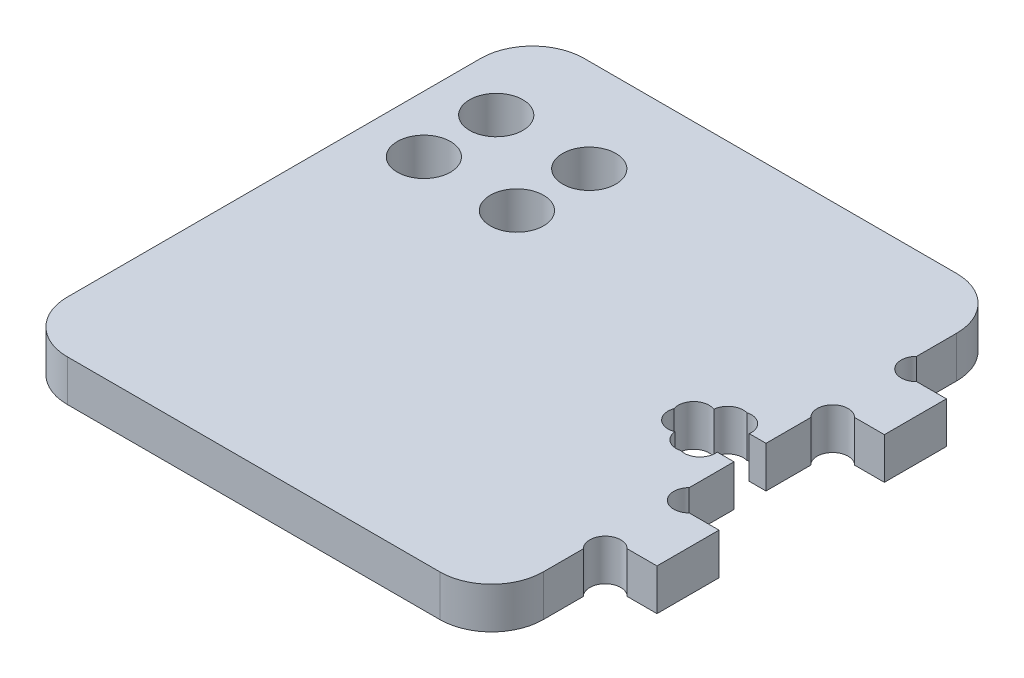
ISO-10303-21;
HEADER;
FILE_DESCRIPTION(('STEP AP214'),'2;1');
FILE_NAME('part.step','',(''),(''),'','','');
FILE_SCHEMA(('AUTOMOTIVE_DESIGN { 1 0 10303 214 1 1 1 1 }'));
ENDSEC;
DATA;
#1=APPLICATION_CONTEXT('core data for automotive mechanical design processes');
#2=APPLICATION_PROTOCOL_DEFINITION('international standard','automotive_design',2000,#1);
#3=PRODUCT_CONTEXT('',#1,'mechanical');
#4=PRODUCT('Part','Part','',(#3));
#5=PRODUCT_RELATED_PRODUCT_CATEGORY('part','',(#4));
#6=PRODUCT_DEFINITION_FORMATION('','',#4);
#7=PRODUCT_DEFINITION_CONTEXT('part definition',#1,'design');
#8=PRODUCT_DEFINITION('design','',#6,#7);
#9=PRODUCT_DEFINITION_SHAPE('','',#8);
#10=(LENGTH_UNIT() NAMED_UNIT(*) SI_UNIT(.MILLI.,.METRE.));
#11=(NAMED_UNIT(*) PLANE_ANGLE_UNIT() SI_UNIT($,.RADIAN.));
#12=(NAMED_UNIT(*) SI_UNIT($,.STERADIAN.) SOLID_ANGLE_UNIT());
#13=UNCERTAINTY_MEASURE_WITH_UNIT(LENGTH_MEASURE(1.E-05),#10,'distance_accuracy_value','');
#14=(GEOMETRIC_REPRESENTATION_CONTEXT(3) GLOBAL_UNCERTAINTY_ASSIGNED_CONTEXT((#13)) GLOBAL_UNIT_ASSIGNED_CONTEXT((#10,
#11,#12)) REPRESENTATION_CONTEXT('',''));
#15=CARTESIAN_POINT('',(0.,0.,0.));
#16=DIRECTION('',(0.,0.,1.));
#17=DIRECTION('',(1.,0.,0.));
#18=AXIS2_PLACEMENT_3D('',#15,#16,#17);
#19=CARTESIAN_POINT('',(-18.025,4.,20.));
#20=DIRECTION('',(0.,-1.,0.));
#21=DIRECTION('',(0.,0.,-1.));
#22=AXIS2_PLACEMENT_3D('',#19,#20,#21);
#23=CYLINDRICAL_SURFACE('',#22,5.);
#24=CARTESIAN_POINT('',(-18.025,0.,20.));
#25=DIRECTION('',(0.,1.,0.));
#26=DIRECTION('',(0.,0.,-1.));
#27=AXIS2_PLACEMENT_3D('',#24,#25,#26);
#28=CIRCLE('',#27,5.);
#29=CARTESIAN_POINT('',(-23.025,0.,20.));
#30=VERTEX_POINT('',#29);
#31=CARTESIAN_POINT('',(-18.025,0.,25.));
#32=VERTEX_POINT('',#31);
#33=EDGE_CURVE('E171',#30,#32,#28,.T.);
#34=ORIENTED_EDGE('',*,*,#33,.T.);
#35=DIRECTION('',(0.,-1.,0.));
#36=VECTOR('',#35,1.);
#37=CARTESIAN_POINT('',(-18.025,4.,25.));
#38=LINE('',#37,#36);
#39=CARTESIAN_POINT('',(-18.025,4.,25.));
#40=VERTEX_POINT('',#39);
#41=EDGE_CURVE('E244',#40,#32,#38,.T.);
#42=ORIENTED_EDGE('',*,*,#41,.F.);
#43=CARTESIAN_POINT('',(-18.025,4.,20.));
#44=DIRECTION('',(0.,1.,0.));
#45=DIRECTION('',(0.,0.,-1.));
#46=AXIS2_PLACEMENT_3D('',#43,#44,#45);
#47=CIRCLE('',#46,5.);
#48=CARTESIAN_POINT('',(-23.025,4.,20.));
#49=VERTEX_POINT('',#48);
#50=EDGE_CURVE('E213',#49,#40,#47,.T.);
#51=ORIENTED_EDGE('',*,*,#50,.F.);
#52=DIRECTION('',(0.,-1.,0.));
#53=VECTOR('',#52,1.);
#54=CARTESIAN_POINT('',(-23.025,4.,20.));
#55=LINE('',#54,#53);
#56=EDGE_CURVE('E167',#49,#30,#55,.T.);
#57=ORIENTED_EDGE('',*,*,#56,.T.);
#58=EDGE_LOOP('',(#34,#42,#51,#57));
#59=FACE_BOUND('',#58,.T.);
#60=ADVANCED_FACE('F33',(#59),#23,.T.);
#61=CARTESIAN_POINT('',(-18.025,4.,25.));
#62=DIRECTION('',(0.,0.,-1.));
#63=DIRECTION('',(-1.,0.,0.));
#64=AXIS2_PLACEMENT_3D('',#61,#62,#63);
#65=PLANE('',#64);
#66=DIRECTION('',(1.,0.,0.));
#67=VECTOR('',#66,1.);
#68=CARTESIAN_POINT('',(-18.025,0.,25.));
#69=LINE('',#68,#67);
#70=CARTESIAN_POINT('',(18.025,0.,25.));
#71=VERTEX_POINT('',#70);
#72=EDGE_CURVE('E174',#32,#71,#69,.T.);
#73=ORIENTED_EDGE('',*,*,#72,.T.);
#74=DIRECTION('',(0.,-1.,0.));
#75=VECTOR('',#74,1.);
#76=CARTESIAN_POINT('',(18.025,4.,25.));
#77=LINE('',#76,#75);
#78=CARTESIAN_POINT('',(18.025,4.,25.));
#79=VERTEX_POINT('',#78);
#80=EDGE_CURVE('E241',#79,#71,#77,.T.);
#81=ORIENTED_EDGE('',*,*,#80,.F.);
#82=DIRECTION('',(1.,0.,0.));
#83=VECTOR('',#82,1.);
#84=CARTESIAN_POINT('',(-18.025,4.,25.));
#85=LINE('',#84,#83);
#86=EDGE_CURVE('E112',#40,#79,#85,.T.);
#87=ORIENTED_EDGE('',*,*,#86,.F.);
#88=ORIENTED_EDGE('',*,*,#41,.T.);
#89=EDGE_LOOP('',(#73,#81,#87,#88));
#90=FACE_BOUND('',#89,.T.);
#91=ADVANCED_FACE('F367',(#90),#65,.F.);
#92=CARTESIAN_POINT('',(18.025,4.,20.));
#93=DIRECTION('',(0.,-1.,0.));
#94=DIRECTION('',(0.,0.,-1.));
#95=AXIS2_PLACEMENT_3D('',#92,#93,#94);
#96=CYLINDRICAL_SURFACE('',#95,5.);
#97=CARTESIAN_POINT('',(18.025,0.,20.));
#98=DIRECTION('',(0.,1.,0.));
#99=DIRECTION('',(0.,0.,1.));
#100=AXIS2_PLACEMENT_3D('',#97,#98,#99);
#101=CIRCLE('',#100,5.);
#102=CARTESIAN_POINT('',(23.025,0.,20.));
#103=VERTEX_POINT('',#102);
#104=EDGE_CURVE('E177',#71,#103,#101,.T.);
#105=ORIENTED_EDGE('',*,*,#104,.T.);
#106=DIRECTION('',(0.,-1.,0.));
#107=VECTOR('',#106,1.);
#108=CARTESIAN_POINT('',(23.025,4.,20.));
#109=LINE('',#108,#107);
#110=CARTESIAN_POINT('',(23.025,4.,20.));
#111=VERTEX_POINT('',#110);
#112=EDGE_CURVE('E238',#111,#103,#109,.T.);
#113=ORIENTED_EDGE('',*,*,#112,.F.);
#114=CARTESIAN_POINT('',(18.025,4.,20.));
#115=DIRECTION('',(0.,1.,0.));
#116=DIRECTION('',(0.,0.,1.));
#117=AXIS2_PLACEMENT_3D('',#114,#115,#116);
#118=CIRCLE('',#117,5.);
#119=EDGE_CURVE('E745',#79,#111,#118,.T.);
#120=ORIENTED_EDGE('',*,*,#119,.F.);
#121=ORIENTED_EDGE('',*,*,#80,.T.);
#122=EDGE_LOOP('',(#105,#113,#120,#121));
#123=FACE_BOUND('',#122,.T.);
#124=ADVANCED_FACE('F371',(#123),#96,.T.);
#125=CARTESIAN_POINT('',(23.025,4.,20.));
#126=DIRECTION('',(-1.,0.,0.));
#127=DIRECTION('',(0.,0.,1.));
#128=AXIS2_PLACEMENT_3D('',#125,#126,#127);
#129=PLANE('',#128);
#130=DIRECTION('',(0.,0.,-1.));
#131=VECTOR('',#130,1.);
#132=CARTESIAN_POINT('',(23.025,0.,20.));
#133=LINE('',#132,#131);
#134=CARTESIAN_POINT('',(23.025,0.,16.1213203435597));
#135=VERTEX_POINT('',#134);
#136=EDGE_CURVE('E179',#103,#135,#133,.T.);
#137=ORIENTED_EDGE('',*,*,#136,.T.);
#138=DIRECTION('',(0.,1.,0.));
#139=VECTOR('',#138,1.);
#140=CARTESIAN_POINT('',(23.025,0.,16.1213203435597));
#141=LINE('',#140,#139);
#142=CARTESIAN_POINT('',(23.025,4.,16.1213203435597));
#143=VERTEX_POINT('',#142);
#144=EDGE_CURVE('E283',#135,#143,#141,.T.);
#145=ORIENTED_EDGE('',*,*,#144,.T.);
#146=DIRECTION('',(0.,0.,-1.));
#147=VECTOR('',#146,1.);
#148=CARTESIAN_POINT('',(23.025,4.,20.));
#149=LINE('',#148,#147);
#150=EDGE_CURVE('E747',#111,#143,#149,.T.);
#151=ORIENTED_EDGE('',*,*,#150,.F.);
#152=ORIENTED_EDGE('',*,*,#112,.T.);
#153=EDGE_LOOP('',(#137,#145,#151,#152));
#154=FACE_BOUND('',#153,.T.);
#155=ADVANCED_FACE('F375',(#154),#129,.F.);
#156=CARTESIAN_POINT('',(23.025,4.,14.));
#157=DIRECTION('',(0.,0.,-1.));
#158=DIRECTION('',(-1.,0.,0.));
#159=AXIS2_PLACEMENT_3D('',#156,#157,#158);
#160=PLANE('',#159);
#161=DIRECTION('',(1.,0.,0.));
#162=VECTOR('',#161,1.);
#163=CARTESIAN_POINT('',(23.025,4.,14.));
#164=LINE('',#163,#162);
#165=CARTESIAN_POINT('',(25.1463203435596,4.,14.));
#166=VERTEX_POINT('',#165);
#167=CARTESIAN_POINT('',(28.025,4.,14.));
#168=VERTEX_POINT('',#167);
#169=EDGE_CURVE('E292',#166,#168,#164,.T.);
#170=ORIENTED_EDGE('',*,*,#169,.F.);
#171=DIRECTION('',(0.,1.,0.));
#172=VECTOR('',#171,1.);
#173=CARTESIAN_POINT('',(25.1463203435596,0.,14.));
#174=LINE('',#173,#172);
#175=CARTESIAN_POINT('',(25.1463203435596,0.,14.));
#176=VERTEX_POINT('',#175);
#177=EDGE_CURVE('E279',#166,#176,#174,.F.);
#178=ORIENTED_EDGE('',*,*,#177,.T.);
#179=DIRECTION('',(1.,0.,0.));
#180=VECTOR('',#179,1.);
#181=CARTESIAN_POINT('',(23.025,0.,14.));
#182=LINE('',#181,#180);
#183=CARTESIAN_POINT('',(28.025,0.,14.));
#184=VERTEX_POINT('',#183);
#185=EDGE_CURVE('E182',#176,#184,#182,.T.);
#186=ORIENTED_EDGE('',*,*,#185,.T.);
#187=DIRECTION('',(0.,-1.,0.));
#188=VECTOR('',#187,1.);
#189=CARTESIAN_POINT('',(28.025,4.,14.));
#190=LINE('',#189,#188);
#191=EDGE_CURVE('E235',#168,#184,#190,.T.);
#192=ORIENTED_EDGE('',*,*,#191,.F.);
#193=EDGE_LOOP('',(#170,#178,#186,#192));
#194=FACE_BOUND('',#193,.T.);
#195=ADVANCED_FACE('F290',(#194),#160,.F.);
#196=CARTESIAN_POINT('',(28.025,4.,8.));
#197=DIRECTION('',(-1.,0.,0.));
#198=DIRECTION('',(0.,0.,1.));
#199=AXIS2_PLACEMENT_3D('',#196,#197,#198);
#200=PLANE('',#199);
#201=DIRECTION('',(0.,0.,-1.));
#202=VECTOR('',#201,1.);
#203=CARTESIAN_POINT('',(28.025,0.,8.));
#204=LINE('',#203,#202);
#205=CARTESIAN_POINT('',(28.025,0.,8.));
#206=VERTEX_POINT('',#205);
#207=EDGE_CURVE('E184',#184,#206,#204,.T.);
#208=ORIENTED_EDGE('',*,*,#207,.T.);
#209=DIRECTION('',(0.,-1.,0.));
#210=VECTOR('',#209,1.);
#211=CARTESIAN_POINT('',(28.025,4.,8.));
#212=LINE('',#211,#210);
#213=CARTESIAN_POINT('',(28.025,4.,8.));
#214=VERTEX_POINT('',#213);
#215=EDGE_CURVE('E232',#214,#206,#212,.T.);
#216=ORIENTED_EDGE('',*,*,#215,.F.);
#217=DIRECTION('',(0.,0.,-1.));
#218=VECTOR('',#217,1.);
#219=CARTESIAN_POINT('',(28.025,4.,8.));
#220=LINE('',#219,#218);
#221=EDGE_CURVE('E314',#168,#214,#220,.T.);
#222=ORIENTED_EDGE('',*,*,#221,.F.);
#223=ORIENTED_EDGE('',*,*,#191,.T.);
#224=EDGE_LOOP('',(#208,#216,#222,#223));
#225=FACE_BOUND('',#224,.T.);
#226=ADVANCED_FACE('F301',(#225),#200,.F.);
#227=CARTESIAN_POINT('',(23.025,4.,8.00000000000001));
#228=DIRECTION('',(0.,0.,1.));
#229=DIRECTION('',(1.,0.,0.));
#230=AXIS2_PLACEMENT_3D('',#227,#228,#229);
#231=PLANE('',#230);
#232=DIRECTION('',(-1.,0.,0.));
#233=VECTOR('',#232,1.);
#234=CARTESIAN_POINT('',(23.025,0.,8.00000000000001));
#235=LINE('',#234,#233);
#236=CARTESIAN_POINT('',(25.1463203435596,0.,8.00000000000001));
#237=VERTEX_POINT('',#236);
#238=EDGE_CURVE('E186',#206,#237,#235,.T.);
#239=ORIENTED_EDGE('',*,*,#238,.T.);
#240=DIRECTION('',(0.,1.,0.));
#241=VECTOR('',#240,1.);
#242=CARTESIAN_POINT('',(25.1463203435596,0.,8.00000000000001));
#243=LINE('',#242,#241);
#244=CARTESIAN_POINT('',(25.1463203435596,4.,8.00000000000001));
#245=VERTEX_POINT('',#244);
#246=EDGE_CURVE('E311',#237,#245,#243,.T.);
#247=ORIENTED_EDGE('',*,*,#246,.T.);
#248=DIRECTION('',(-1.,0.,0.));
#249=VECTOR('',#248,1.);
#250=CARTESIAN_POINT('',(23.025,4.,8.00000000000001));
#251=LINE('',#250,#249);
#252=EDGE_CURVE('E308',#214,#245,#251,.T.);
#253=ORIENTED_EDGE('',*,*,#252,.F.);
#254=ORIENTED_EDGE('',*,*,#215,.T.);
#255=EDGE_LOOP('',(#239,#247,#253,#254));
#256=FACE_BOUND('',#255,.T.);
#257=ADVANCED_FACE('F305',(#256),#231,.F.);
#258=CARTESIAN_POINT('',(23.025,4.,8.00000000000001));
#259=DIRECTION('',(-1.,0.,0.));
#260=DIRECTION('',(0.,0.,1.));
#261=AXIS2_PLACEMENT_3D('',#258,#259,#260);
#262=PLANE('',#261);
#263=DIRECTION('',(0.,0.,-1.));
#264=VECTOR('',#263,1.);
#265=CARTESIAN_POINT('',(23.025,4.,8.00000000000001));
#266=LINE('',#265,#264);
#267=CARTESIAN_POINT('',(23.025,4.,5.87867965644035));
#268=VERTEX_POINT('',#267);
#269=CARTESIAN_POINT('',(23.025,4.,1.55));
#270=VERTEX_POINT('',#269);
#271=EDGE_CURVE('E313',#268,#270,#266,.T.);
#272=ORIENTED_EDGE('',*,*,#271,.F.);
#273=DIRECTION('',(0.,1.,0.));
#274=VECTOR('',#273,1.);
#275=CARTESIAN_POINT('',(23.025,0.,5.87867965644035));
#276=LINE('',#275,#274);
#277=CARTESIAN_POINT('',(23.025,0.,5.87867965644035));
#278=VERTEX_POINT('',#277);
#279=EDGE_CURVE('E684',#268,#278,#276,.F.);
#280=ORIENTED_EDGE('',*,*,#279,.T.);
#281=DIRECTION('',(0.,0.,-1.));
#282=VECTOR('',#281,1.);
#283=CARTESIAN_POINT('',(23.025,0.,8.00000000000001));
#284=LINE('',#283,#282);
#285=CARTESIAN_POINT('',(23.025,0.,1.55));
#286=VERTEX_POINT('',#285);
#287=EDGE_CURVE('E189',#278,#286,#284,.T.);
#288=ORIENTED_EDGE('',*,*,#287,.T.);
#289=DIRECTION('',(0.,-1.,0.));
#290=VECTOR('',#289,1.);
#291=CARTESIAN_POINT('',(23.025,4.,1.55));
#292=LINE('',#291,#290);
#293=EDGE_CURVE('E229',#270,#286,#292,.T.);
#294=ORIENTED_EDGE('',*,*,#293,.F.);
#295=EDGE_LOOP('',(#272,#280,#288,#294));
#296=FACE_BOUND('',#295,.T.);
#297=ADVANCED_FACE('F388',(#296),#262,.F.);
#298=CARTESIAN_POINT('',(20.975,4.,1.55));
#299=DIRECTION('',(0.,0.,1.));
#300=DIRECTION('',(1.,0.,0.));
#301=AXIS2_PLACEMENT_3D('',#298,#299,#300);
#302=PLANE('',#301);
#303=DIRECTION('',(-1.,0.,0.));
#304=VECTOR('',#303,1.);
#305=CARTESIAN_POINT('',(20.975,0.,1.55));
#306=LINE('',#305,#304);
#307=CARTESIAN_POINT('',(21.4023419886519,0.,1.55));
#308=VERTEX_POINT('',#307);
#309=EDGE_CURVE('E191',#286,#308,#306,.T.);
#310=ORIENTED_EDGE('',*,*,#309,.T.);
#311=DIRECTION('',(0.,1.,0.));
#312=VECTOR('',#311,1.);
#313=CARTESIAN_POINT('',(21.4023419886519,0.,1.55));
#314=LINE('',#313,#312);
#315=CARTESIAN_POINT('',(21.4023419886519,4.,1.55));
#316=VERTEX_POINT('',#315);
#317=EDGE_CURVE('E726',#308,#316,#314,.T.);
#318=ORIENTED_EDGE('',*,*,#317,.T.);
#319=DIRECTION('',(-1.,0.,0.));
#320=VECTOR('',#319,1.);
#321=CARTESIAN_POINT('',(20.975,4.,1.55));
#322=LINE('',#321,#320);
#323=EDGE_CURVE('E316',#270,#316,#322,.T.);
#324=ORIENTED_EDGE('',*,*,#323,.F.);
#325=ORIENTED_EDGE('',*,*,#293,.T.);
#326=EDGE_LOOP('',(#310,#318,#324,#325));
#327=FACE_BOUND('',#326,.T.);
#328=ADVANCED_FACE('F391',(#327),#302,.F.);
#329=CARTESIAN_POINT('',(20.975,4.,-1.54999999999999));
#330=DIRECTION('',(0.,0.,-1.));
#331=DIRECTION('',(-1.,0.,0.));
#332=AXIS2_PLACEMENT_3D('',#329,#330,#331);
#333=PLANE('',#332);
#334=DIRECTION('',(1.,0.,0.));
#335=VECTOR('',#334,1.);
#336=CARTESIAN_POINT('',(20.975,4.,-1.54999999999999));
#337=LINE('',#336,#335);
#338=CARTESIAN_POINT('',(21.4023419886519,4.,-1.54999999999999));
#339=VERTEX_POINT('',#338);
#340=CARTESIAN_POINT('',(23.025,4.,-1.54999999999999));
#341=VERTEX_POINT('',#340);
#342=EDGE_CURVE('E323',#339,#341,#337,.T.);
#343=ORIENTED_EDGE('',*,*,#342,.F.);
#344=DIRECTION('',(0.,1.,0.));
#345=VECTOR('',#344,1.);
#346=CARTESIAN_POINT('',(21.4023419886519,0.,-1.54999999999999));
#347=LINE('',#346,#345);
#348=CARTESIAN_POINT('',(21.4023419886519,0.,-1.54999999999999));
#349=VERTEX_POINT('',#348);
#350=EDGE_CURVE('E175',#349,#339,#347,.T.);
#351=ORIENTED_EDGE('',*,*,#350,.F.);
#352=DIRECTION('',(1.,0.,0.));
#353=VECTOR('',#352,1.);
#354=CARTESIAN_POINT('',(20.975,0.,-1.54999999999999));
#355=LINE('',#354,#353);
#356=CARTESIAN_POINT('',(23.025,0.,-1.54999999999999));
#357=VERTEX_POINT('',#356);
#358=EDGE_CURVE('E194',#349,#357,#355,.T.);
#359=ORIENTED_EDGE('',*,*,#358,.T.);
#360=DIRECTION('',(0.,-1.,0.));
#361=VECTOR('',#360,1.);
#362=CARTESIAN_POINT('',(23.025,4.,-1.54999999999999));
#363=LINE('',#362,#361);
#364=EDGE_CURVE('E226',#341,#357,#363,.T.);
#365=ORIENTED_EDGE('',*,*,#364,.F.);
#366=EDGE_LOOP('',(#343,#351,#359,#365));
#367=FACE_BOUND('',#366,.T.);
#368=ADVANCED_FACE('F395',(#367),#333,.F.);
#369=CARTESIAN_POINT('',(23.025,4.,-1.54999999999999));
#370=DIRECTION('',(-1.,0.,0.));
#371=DIRECTION('',(0.,0.,1.));
#372=AXIS2_PLACEMENT_3D('',#369,#370,#371);
#373=PLANE('',#372);
#374=DIRECTION('',(0.,0.,-1.));
#375=VECTOR('',#374,1.);
#376=CARTESIAN_POINT('',(23.025,0.,-1.54999999999999));
#377=LINE('',#376,#375);
#378=CARTESIAN_POINT('',(23.025,0.,-5.87867965644035));
#379=VERTEX_POINT('',#378);
#380=EDGE_CURVE('E196',#357,#379,#377,.T.);
#381=ORIENTED_EDGE('',*,*,#380,.T.);
#382=DIRECTION('',(0.,1.,0.));
#383=VECTOR('',#382,1.);
#384=CARTESIAN_POINT('',(23.025,0.,-5.87867965644035));
#385=LINE('',#384,#383);
#386=CARTESIAN_POINT('',(23.025,4.,-5.87867965644035));
#387=VERTEX_POINT('',#386);
#388=EDGE_CURVE('E696',#379,#387,#385,.T.);
#389=ORIENTED_EDGE('',*,*,#388,.T.);
#390=DIRECTION('',(0.,0.,-1.));
#391=VECTOR('',#390,1.);
#392=CARTESIAN_POINT('',(23.025,4.,-1.54999999999999));
#393=LINE('',#392,#391);
#394=EDGE_CURVE('E325',#341,#387,#393,.T.);
#395=ORIENTED_EDGE('',*,*,#394,.F.);
#396=ORIENTED_EDGE('',*,*,#364,.T.);
#397=EDGE_LOOP('',(#381,#389,#395,#396));
#398=FACE_BOUND('',#397,.T.);
#399=ADVANCED_FACE('F399',(#398),#373,.F.);
#400=CARTESIAN_POINT('',(23.025,4.,-8.00000000000001));
#401=DIRECTION('',(0.,0.,-1.));
#402=DIRECTION('',(-1.,0.,0.));
#403=AXIS2_PLACEMENT_3D('',#400,#401,#402);
#404=PLANE('',#403);
#405=DIRECTION('',(1.,0.,0.));
#406=VECTOR('',#405,1.);
#407=CARTESIAN_POINT('',(23.025,4.,-8.00000000000001));
#408=LINE('',#407,#406);
#409=CARTESIAN_POINT('',(25.1463203435596,4.,-8.00000000000001));
#410=VERTEX_POINT('',#409);
#411=CARTESIAN_POINT('',(28.025,4.,-8.));
#412=VERTEX_POINT('',#411);
#413=EDGE_CURVE('E328',#410,#412,#408,.T.);
#414=ORIENTED_EDGE('',*,*,#413,.F.);
#415=DIRECTION('',(0.,1.,0.));
#416=VECTOR('',#415,1.);
#417=CARTESIAN_POINT('',(25.1463203435596,0.,-8.00000000000001));
#418=LINE('',#417,#416);
#419=CARTESIAN_POINT('',(25.1463203435596,0.,-8.00000000000001));
#420=VERTEX_POINT('',#419);
#421=EDGE_CURVE('E693',#410,#420,#418,.F.);
#422=ORIENTED_EDGE('',*,*,#421,.T.);
#423=DIRECTION('',(1.,0.,0.));
#424=VECTOR('',#423,1.);
#425=CARTESIAN_POINT('',(23.025,0.,-8.00000000000001));
#426=LINE('',#425,#424);
#427=CARTESIAN_POINT('',(28.025,0.,-8.));
#428=VERTEX_POINT('',#427);
#429=EDGE_CURVE('E199',#420,#428,#426,.T.);
#430=ORIENTED_EDGE('',*,*,#429,.T.);
#431=DIRECTION('',(0.,-1.,0.));
#432=VECTOR('',#431,1.);
#433=CARTESIAN_POINT('',(28.025,4.,-8.));
#434=LINE('',#433,#432);
#435=EDGE_CURVE('E223',#412,#428,#434,.T.);
#436=ORIENTED_EDGE('',*,*,#435,.F.);
#437=EDGE_LOOP('',(#414,#422,#430,#436));
#438=FACE_BOUND('',#437,.T.);
#439=ADVANCED_FACE('F403',(#438),#404,.F.);
#440=CARTESIAN_POINT('',(28.025,4.,-14.));
#441=DIRECTION('',(-1.,0.,0.));
#442=DIRECTION('',(0.,0.,1.));
#443=AXIS2_PLACEMENT_3D('',#440,#441,#442);
#444=PLANE('',#443);
#445=DIRECTION('',(0.,0.,-1.));
#446=VECTOR('',#445,1.);
#447=CARTESIAN_POINT('',(28.025,0.,-14.));
#448=LINE('',#447,#446);
#449=CARTESIAN_POINT('',(28.025,0.,-14.));
#450=VERTEX_POINT('',#449);
#451=EDGE_CURVE('E201',#428,#450,#448,.T.);
#452=ORIENTED_EDGE('',*,*,#451,.T.);
#453=DIRECTION('',(0.,-1.,0.));
#454=VECTOR('',#453,1.);
#455=CARTESIAN_POINT('',(28.025,4.,-14.));
#456=LINE('',#455,#454);
#457=CARTESIAN_POINT('',(28.025,4.,-14.));
#458=VERTEX_POINT('',#457);
#459=EDGE_CURVE('E220',#458,#450,#456,.T.);
#460=ORIENTED_EDGE('',*,*,#459,.F.);
#461=DIRECTION('',(0.,0.,-1.));
#462=VECTOR('',#461,1.);
#463=CARTESIAN_POINT('',(28.025,4.,-14.));
#464=LINE('',#463,#462);
#465=EDGE_CURVE('E330',#412,#458,#464,.T.);
#466=ORIENTED_EDGE('',*,*,#465,.F.);
#467=ORIENTED_EDGE('',*,*,#435,.T.);
#468=EDGE_LOOP('',(#452,#460,#466,#467));
#469=FACE_BOUND('',#468,.T.);
#470=ADVANCED_FACE('F407',(#469),#444,.F.);
#471=CARTESIAN_POINT('',(23.025,4.,-14.));
#472=DIRECTION('',(0.,0.,1.));
#473=DIRECTION('',(1.,0.,0.));
#474=AXIS2_PLACEMENT_3D('',#471,#472,#473);
#475=PLANE('',#474);
#476=DIRECTION('',(-1.,0.,0.));
#477=VECTOR('',#476,1.);
#478=CARTESIAN_POINT('',(23.025,0.,-14.));
#479=LINE('',#478,#477);
#480=CARTESIAN_POINT('',(25.1463203435596,0.,-14.));
#481=VERTEX_POINT('',#480);
#482=EDGE_CURVE('E203',#450,#481,#479,.T.);
#483=ORIENTED_EDGE('',*,*,#482,.T.);
#484=DIRECTION('',(0.,1.,0.));
#485=VECTOR('',#484,1.);
#486=CARTESIAN_POINT('',(25.1463203435596,0.,-14.));
#487=LINE('',#486,#485);
#488=CARTESIAN_POINT('',(25.1463203435596,4.,-14.));
#489=VERTEX_POINT('',#488);
#490=EDGE_CURVE('E702',#481,#489,#487,.T.);
#491=ORIENTED_EDGE('',*,*,#490,.T.);
#492=DIRECTION('',(-1.,0.,0.));
#493=VECTOR('',#492,1.);
#494=CARTESIAN_POINT('',(23.025,4.,-14.));
#495=LINE('',#494,#493);
#496=EDGE_CURVE('E332',#458,#489,#495,.T.);
#497=ORIENTED_EDGE('',*,*,#496,.F.);
#498=ORIENTED_EDGE('',*,*,#459,.T.);
#499=EDGE_LOOP('',(#483,#491,#497,#498));
#500=FACE_BOUND('',#499,.T.);
#501=ADVANCED_FACE('F411',(#500),#475,.F.);
#502=CARTESIAN_POINT('',(23.025,4.,-14.));
#503=DIRECTION('',(-1.,0.,0.));
#504=DIRECTION('',(0.,0.,1.));
#505=AXIS2_PLACEMENT_3D('',#502,#503,#504);
#506=PLANE('',#505);
#507=DIRECTION('',(0.,0.,-1.));
#508=VECTOR('',#507,1.);
#509=CARTESIAN_POINT('',(23.025,4.,-14.));
#510=LINE('',#509,#508);
#511=CARTESIAN_POINT('',(23.025,4.,-16.1213203435597));
#512=VERTEX_POINT('',#511);
#513=CARTESIAN_POINT('',(23.025,4.,-20.));
#514=VERTEX_POINT('',#513);
#515=EDGE_CURVE('E335',#512,#514,#510,.T.);
#516=ORIENTED_EDGE('',*,*,#515,.F.);
#517=DIRECTION('',(0.,1.,0.));
#518=VECTOR('',#517,1.);
#519=CARTESIAN_POINT('',(23.025,0.,-16.1213203435597));
#520=LINE('',#519,#518);
#521=CARTESIAN_POINT('',(23.025,0.,-16.1213203435597));
#522=VERTEX_POINT('',#521);
#523=EDGE_CURVE('E700',#512,#522,#520,.F.);
#524=ORIENTED_EDGE('',*,*,#523,.T.);
#525=DIRECTION('',(0.,0.,-1.));
#526=VECTOR('',#525,1.);
#527=CARTESIAN_POINT('',(23.025,0.,-14.));
#528=LINE('',#527,#526);
#529=CARTESIAN_POINT('',(23.025,0.,-20.));
#530=VERTEX_POINT('',#529);
#531=EDGE_CURVE('E206',#522,#530,#528,.T.);
#532=ORIENTED_EDGE('',*,*,#531,.T.);
#533=DIRECTION('',(0.,-1.,0.));
#534=VECTOR('',#533,1.);
#535=CARTESIAN_POINT('',(23.025,4.,-20.));
#536=LINE('',#535,#534);
#537=EDGE_CURVE('E217',#514,#530,#536,.T.);
#538=ORIENTED_EDGE('',*,*,#537,.F.);
#539=EDGE_LOOP('',(#516,#524,#532,#538));
#540=FACE_BOUND('',#539,.T.);
#541=ADVANCED_FACE('F345',(#540),#506,.F.);
#542=CARTESIAN_POINT('',(18.025,4.,-20.));
#543=DIRECTION('',(0.,-1.,0.));
#544=DIRECTION('',(0.,0.,-1.));
#545=AXIS2_PLACEMENT_3D('',#542,#543,#544);
#546=CYLINDRICAL_SURFACE('',#545,5.);
#547=CARTESIAN_POINT('',(18.025,0.,-20.));
#548=DIRECTION('',(0.,1.,0.));
#549=DIRECTION('',(0.,0.,-1.));
#550=AXIS2_PLACEMENT_3D('',#547,#548,#549);
#551=CIRCLE('',#550,5.);
#552=CARTESIAN_POINT('',(18.025,0.,-25.));
#553=VERTEX_POINT('',#552);
#554=EDGE_CURVE('E208',#530,#553,#551,.T.);
#555=ORIENTED_EDGE('',*,*,#554,.T.);
#556=DIRECTION('',(0.,-1.,0.));
#557=VECTOR('',#556,1.);
#558=CARTESIAN_POINT('',(18.025,4.,-25.));
#559=LINE('',#558,#557);
#560=CARTESIAN_POINT('',(18.025,4.,-25.));
#561=VERTEX_POINT('',#560);
#562=EDGE_CURVE('E162',#561,#553,#559,.T.);
#563=ORIENTED_EDGE('',*,*,#562,.F.);
#564=CARTESIAN_POINT('',(18.025,4.,-20.));
#565=DIRECTION('',(0.,1.,0.));
#566=DIRECTION('',(0.,0.,-1.));
#567=AXIS2_PLACEMENT_3D('',#564,#565,#566);
#568=CIRCLE('',#567,5.);
#569=EDGE_CURVE('E153',#514,#561,#568,.T.);
#570=ORIENTED_EDGE('',*,*,#569,.F.);
#571=ORIENTED_EDGE('',*,*,#537,.T.);
#572=EDGE_LOOP('',(#555,#563,#570,#571));
#573=FACE_BOUND('',#572,.T.);
#574=ADVANCED_FACE('F349',(#573),#546,.T.);
#575=CARTESIAN_POINT('',(-18.025,4.,-25.));
#576=DIRECTION('',(0.,0.,1.));
#577=DIRECTION('',(1.,0.,0.));
#578=AXIS2_PLACEMENT_3D('',#575,#576,#577);
#579=PLANE('',#578);
#580=DIRECTION('',(-1.,0.,0.));
#581=VECTOR('',#580,1.);
#582=CARTESIAN_POINT('',(-18.025,0.,-25.));
#583=LINE('',#582,#581);
#584=CARTESIAN_POINT('',(-18.025,0.,-25.));
#585=VERTEX_POINT('',#584);
#586=EDGE_CURVE('E161',#553,#585,#583,.T.);
#587=ORIENTED_EDGE('',*,*,#586,.T.);
#588=DIRECTION('',(0.,-1.,0.));
#589=VECTOR('',#588,1.);
#590=CARTESIAN_POINT('',(-18.025,4.,-25.));
#591=LINE('',#590,#589);
#592=CARTESIAN_POINT('',(-18.025,4.,-25.));
#593=VERTEX_POINT('',#592);
#594=EDGE_CURVE('E158',#593,#585,#591,.T.);
#595=ORIENTED_EDGE('',*,*,#594,.F.);
#596=DIRECTION('',(-1.,0.,0.));
#597=VECTOR('',#596,1.);
#598=CARTESIAN_POINT('',(-18.025,4.,-25.));
#599=LINE('',#598,#597);
#600=EDGE_CURVE('E146',#561,#593,#599,.T.);
#601=ORIENTED_EDGE('',*,*,#600,.F.);
#602=ORIENTED_EDGE('',*,*,#562,.T.);
#603=EDGE_LOOP('',(#587,#595,#601,#602));
#604=FACE_BOUND('',#603,.T.);
#605=ADVANCED_FACE('F159',(#604),#579,.F.);
#606=CARTESIAN_POINT('',(-18.025,4.,-20.));
#607=DIRECTION('',(0.,-1.,0.));
#608=DIRECTION('',(0.,0.,-1.));
#609=AXIS2_PLACEMENT_3D('',#606,#607,#608);
#610=CYLINDRICAL_SURFACE('',#609,5.);
#611=CARTESIAN_POINT('',(-18.025,0.,-20.));
#612=DIRECTION('',(0.,1.,0.));
#613=DIRECTION('',(0.,0.,-1.));
#614=AXIS2_PLACEMENT_3D('',#611,#612,#613);
#615=CIRCLE('',#614,5.);
#616=CARTESIAN_POINT('',(-23.025,0.,-20.));
#617=VERTEX_POINT('',#616);
#618=EDGE_CURVE('E97',#585,#617,#615,.T.);
#619=ORIENTED_EDGE('',*,*,#618,.T.);
#620=DIRECTION('',(0.,-1.,0.));
#621=VECTOR('',#620,1.);
#622=CARTESIAN_POINT('',(-23.025,4.,-20.));
#623=LINE('',#622,#621);
#624=CARTESIAN_POINT('',(-23.025,4.,-20.));
#625=VERTEX_POINT('',#624);
#626=EDGE_CURVE('E163',#625,#617,#623,.T.);
#627=ORIENTED_EDGE('',*,*,#626,.F.);
#628=CARTESIAN_POINT('',(-18.025,4.,-20.));
#629=DIRECTION('',(0.,1.,0.));
#630=DIRECTION('',(0.,0.,-1.));
#631=AXIS2_PLACEMENT_3D('',#628,#629,#630);
#632=CIRCLE('',#631,5.);
#633=EDGE_CURVE('E151',#593,#625,#632,.T.);
#634=ORIENTED_EDGE('',*,*,#633,.F.);
#635=ORIENTED_EDGE('',*,*,#594,.T.);
#636=EDGE_LOOP('',(#619,#627,#634,#635));
#637=FACE_BOUND('',#636,.T.);
#638=ADVANCED_FACE('F165',(#637),#610,.T.);
#639=CARTESIAN_POINT('',(-23.025,4.,20.));
#640=DIRECTION('',(1.,0.,0.));
#641=DIRECTION('',(0.,0.,-1.));
#642=AXIS2_PLACEMENT_3D('',#639,#640,#641);
#643=PLANE('',#642);
#644=DIRECTION('',(0.,0.,1.));
#645=VECTOR('',#644,1.);
#646=CARTESIAN_POINT('',(-23.025,0.,20.));
#647=LINE('',#646,#645);
#648=EDGE_CURVE('E103',#617,#30,#647,.T.);
#649=ORIENTED_EDGE('',*,*,#648,.T.);
#650=ORIENTED_EDGE('',*,*,#56,.F.);
#651=DIRECTION('',(0.,0.,1.));
#652=VECTOR('',#651,1.);
#653=CARTESIAN_POINT('',(-23.025,4.,20.));
#654=LINE('',#653,#652);
#655=EDGE_CURVE('E49',#625,#49,#654,.T.);
#656=ORIENTED_EDGE('',*,*,#655,.F.);
#657=ORIENTED_EDGE('',*,*,#626,.T.);
#658=EDGE_LOOP('',(#649,#650,#656,#657));
#659=FACE_BOUND('',#658,.T.);
#660=ADVANCED_FACE('F355',(#659),#643,.F.);
#661=CARTESIAN_POINT('',(-18.025,4.,20.));
#662=DIRECTION('',(0.,-1.,0.));
#663=DIRECTION('',(0.,0.,-1.));
#664=AXIS2_PLACEMENT_3D('',#661,#662,#663);
#665=PLANE('',#664);
#666=CARTESIAN_POINT('',(-17.525,4.,-9.00000000000002));
#667=DIRECTION('',(0.,1.,0.));
#668=DIRECTION('',(0.,0.,1.));
#669=AXIS2_PLACEMENT_3D('',#666,#667,#668);
#670=CIRCLE('',#669,2.575);
#671=CARTESIAN_POINT('',(-17.525,4.,-6.42500000000002));
#672=VERTEX_POINT('',#671);
#673=EDGE_CURVE('E659',#672,#672,#670,.T.);
#674=ORIENTED_EDGE('',*,*,#673,.F.);
#675=EDGE_LOOP('',(#674));
#676=FACE_BOUND('',#675,.T.);
#677=CARTESIAN_POINT('',(-8.525,4.,-9.00000000000002));
#678=DIRECTION('',(0.,1.,0.));
#679=DIRECTION('',(0.,0.,1.));
#680=AXIS2_PLACEMENT_3D('',#677,#678,#679);
#681=CIRCLE('',#680,2.575);
#682=CARTESIAN_POINT('',(-8.525,4.,-6.42500000000002));
#683=VERTEX_POINT('',#682);
#684=EDGE_CURVE('E661',#683,#683,#681,.T.);
#685=ORIENTED_EDGE('',*,*,#684,.F.);
#686=EDGE_LOOP('',(#685));
#687=FACE_BOUND('',#686,.T.);
#688=CARTESIAN_POINT('',(-8.525,4.,-16.));
#689=DIRECTION('',(0.,1.,0.));
#690=DIRECTION('',(0.,0.,1.));
#691=AXIS2_PLACEMENT_3D('',#688,#689,#690);
#692=CIRCLE('',#691,2.575);
#693=CARTESIAN_POINT('',(-8.525,4.,-13.425));
#694=VERTEX_POINT('',#693);
#695=EDGE_CURVE('E667',#694,#694,#692,.T.);
#696=ORIENTED_EDGE('',*,*,#695,.F.);
#697=EDGE_LOOP('',(#696));
#698=FACE_BOUND('',#697,.T.);
#699=CARTESIAN_POINT('',(-17.525,4.,-16.));
#700=DIRECTION('',(0.,1.,0.));
#701=DIRECTION('',(0.,0.,1.));
#702=AXIS2_PLACEMENT_3D('',#699,#700,#701);
#703=CIRCLE('',#702,2.575);
#704=CARTESIAN_POINT('',(-17.525,4.,-13.425));
#705=VERTEX_POINT('',#704);
#706=EDGE_CURVE('E673',#705,#705,#703,.T.);
#707=ORIENTED_EDGE('',*,*,#706,.F.);
#708=EDGE_LOOP('',(#707));
#709=FACE_BOUND('',#708,.T.);
#710=ORIENTED_EDGE('',*,*,#252,.T.);
#711=CARTESIAN_POINT('',(24.0856601717798,4.,6.93933982822019));
#712=DIRECTION('',(0.,1.,0.));
#713=DIRECTION('',(0.,0.,-1.));
#714=AXIS2_PLACEMENT_3D('',#711,#712,#713);
#715=CIRCLE('',#714,1.5);
#716=EDGE_CURVE('E679',#268,#245,#715,.T.);
#717=ORIENTED_EDGE('',*,*,#716,.F.);
#718=ORIENTED_EDGE('',*,*,#271,.T.);
#719=ORIENTED_EDGE('',*,*,#323,.T.);
#720=CARTESIAN_POINT('',(19.9143398282202,4.,1.73933982822018));
#721=DIRECTION('',(0.,1.,0.));
#722=DIRECTION('',(0.,0.,1.));
#723=AXIS2_PLACEMENT_3D('',#720,#721,#722);
#724=CIRCLE('',#723,1.5);
#725=CARTESIAN_POINT('',(19.525,4.,3.18793034943778));
#726=VERTEX_POINT('',#725);
#727=EDGE_CURVE('E720',#726,#316,#724,.T.);
#728=ORIENTED_EDGE('',*,*,#727,.F.);
#729=CARTESIAN_POINT('',(19.1356601717798,4.,1.73933982822018));
#730=DIRECTION('',(0.,1.,0.));
#731=DIRECTION('',(0.,0.,1.));
#732=AXIS2_PLACEMENT_3D('',#729,#730,#731);
#733=CIRCLE('',#732,1.5);
#734=CARTESIAN_POINT('',(17.6424751624632,4.,1.88216324349948));
#735=VERTEX_POINT('',#734);
#736=EDGE_CURVE('E717',#735,#726,#733,.T.);
#737=ORIENTED_EDGE('',*,*,#736,.F.);
#738=CARTESIAN_POINT('',(17.0856601717798,4.,0.489339828220176));
#739=DIRECTION('',(0.,1.,0.));
#740=DIRECTION('',(0.,0.,1.));
#741=AXIS2_PLACEMENT_3D('',#738,#739,#740);
#742=CIRCLE('',#741,1.5);
#743=CARTESIAN_POINT('',(15.667722749847,4.,0.));
#744=VERTEX_POINT('',#743);
#745=EDGE_CURVE('E714',#744,#735,#742,.T.);
#746=ORIENTED_EDGE('',*,*,#745,.F.);
#747=CARTESIAN_POINT('',(17.0856601717798,4.,-0.48933982822017));
#748=DIRECTION('',(0.,1.,0.));
#749=DIRECTION('',(0.,0.,1.));
#750=AXIS2_PLACEMENT_3D('',#747,#748,#749);
#751=CIRCLE('',#750,1.5);
#752=CARTESIAN_POINT('',(17.6424751624632,4.,-1.88216324349947));
#753=VERTEX_POINT('',#752);
#754=EDGE_CURVE('E711',#753,#744,#751,.T.);
#755=ORIENTED_EDGE('',*,*,#754,.F.);
#756=CARTESIAN_POINT('',(19.1356601717798,4.,-1.73933982822017));
#757=DIRECTION('',(0.,1.,0.));
#758=DIRECTION('',(0.,0.,1.));
#759=AXIS2_PLACEMENT_3D('',#756,#757,#758);
#760=CIRCLE('',#759,1.5);
#761=CARTESIAN_POINT('',(19.525,4.,-3.18793034943778));
#762=VERTEX_POINT('',#761);
#763=EDGE_CURVE('E708',#762,#753,#760,.T.);
#764=ORIENTED_EDGE('',*,*,#763,.F.);
#765=CARTESIAN_POINT('',(19.9143398282202,4.,-1.73933982822017));
#766=DIRECTION('',(0.,1.,0.));
#767=DIRECTION('',(0.,0.,1.));
#768=AXIS2_PLACEMENT_3D('',#765,#766,#767);
#769=CIRCLE('',#768,1.5);
#770=EDGE_CURVE('E705',#339,#762,#769,.T.);
#771=ORIENTED_EDGE('',*,*,#770,.F.);
#772=ORIENTED_EDGE('',*,*,#342,.T.);
#773=ORIENTED_EDGE('',*,*,#394,.T.);
#774=CARTESIAN_POINT('',(24.0856601717798,4.,-6.93933982822019));
#775=DIRECTION('',(0.,1.,0.));
#776=DIRECTION('',(0.,0.,1.));
#777=AXIS2_PLACEMENT_3D('',#774,#775,#776);
#778=CIRCLE('',#777,1.5);
#779=EDGE_CURVE('E690',#410,#387,#778,.T.);
#780=ORIENTED_EDGE('',*,*,#779,.F.);
#781=ORIENTED_EDGE('',*,*,#413,.T.);
#782=ORIENTED_EDGE('',*,*,#465,.T.);
#783=ORIENTED_EDGE('',*,*,#496,.T.);
#784=CARTESIAN_POINT('',(24.0856601717798,4.,-15.0606601717798));
#785=DIRECTION('',(0.,1.,0.));
#786=DIRECTION('',(0.,0.,1.));
#787=AXIS2_PLACEMENT_3D('',#784,#785,#786);
#788=CIRCLE('',#787,1.5);
#789=EDGE_CURVE('E341',#512,#489,#788,.T.);
#790=ORIENTED_EDGE('',*,*,#789,.F.);
#791=ORIENTED_EDGE('',*,*,#515,.T.);
#792=ORIENTED_EDGE('',*,*,#569,.T.);
#793=ORIENTED_EDGE('',*,*,#600,.T.);
#794=ORIENTED_EDGE('',*,*,#633,.T.);
#795=ORIENTED_EDGE('',*,*,#655,.T.);
#796=ORIENTED_EDGE('',*,*,#50,.T.);
#797=ORIENTED_EDGE('',*,*,#86,.T.);
#798=ORIENTED_EDGE('',*,*,#119,.T.);
#799=ORIENTED_EDGE('',*,*,#150,.T.);
#800=CARTESIAN_POINT('',(24.0856601717798,4.,15.0606601717798));
#801=DIRECTION('',(0.,1.,0.));
#802=DIRECTION('',(0.,0.,-1.));
#803=AXIS2_PLACEMENT_3D('',#800,#801,#802);
#804=CIRCLE('',#803,1.5);
#805=EDGE_CURVE('E293',#166,#143,#804,.T.);
#806=ORIENTED_EDGE('',*,*,#805,.F.);
#807=ORIENTED_EDGE('',*,*,#169,.T.);
#808=ORIENTED_EDGE('',*,*,#221,.T.);
#809=EDGE_LOOP('',(#710,#717,#718,#719,#728,#737,#746,#755,#764,#771,#772,#773,#780,#781,#782,
#783,#790,#791,#792,#793,#794,#795,#796,#797,#798,#799,#806,#807,#808));
#810=FACE_BOUND('',#809,.T.);
#811=ADVANCED_FACE('F149',(#676,#687,#698,#709,#810),#665,.F.);
#812=CARTESIAN_POINT('',(-18.025,0.,20.));
#813=DIRECTION('',(0.,-1.,0.));
#814=DIRECTION('',(0.,0.,-1.));
#815=AXIS2_PLACEMENT_3D('',#812,#813,#814);
#816=PLANE('',#815);
#817=CARTESIAN_POINT('',(-17.525,0.,-9.00000000000002));
#818=DIRECTION('',(0.,1.,0.));
#819=DIRECTION('',(0.,0.,1.));
#820=AXIS2_PLACEMENT_3D('',#817,#818,#819);
#821=CIRCLE('',#820,2.575);
#822=CARTESIAN_POINT('',(-17.525,0.,-6.42500000000002));
#823=VERTEX_POINT('',#822);
#824=EDGE_CURVE('E656',#823,#823,#821,.T.);
#825=ORIENTED_EDGE('',*,*,#824,.T.);
#826=EDGE_LOOP('',(#825));
#827=FACE_BOUND('',#826,.T.);
#828=CARTESIAN_POINT('',(-8.525,0.,-9.00000000000002));
#829=DIRECTION('',(0.,1.,0.));
#830=DIRECTION('',(0.,0.,1.));
#831=AXIS2_PLACEMENT_3D('',#828,#829,#830);
#832=CIRCLE('',#831,2.575);
#833=CARTESIAN_POINT('',(-8.525,0.,-6.42500000000002));
#834=VERTEX_POINT('',#833);
#835=EDGE_CURVE('E664',#834,#834,#832,.T.);
#836=ORIENTED_EDGE('',*,*,#835,.T.);
#837=EDGE_LOOP('',(#836));
#838=FACE_BOUND('',#837,.T.);
#839=CARTESIAN_POINT('',(-8.525,0.,-16.));
#840=DIRECTION('',(0.,1.,0.));
#841=DIRECTION('',(0.,0.,1.));
#842=AXIS2_PLACEMENT_3D('',#839,#840,#841);
#843=CIRCLE('',#842,2.575);
#844=CARTESIAN_POINT('',(-8.525,0.,-13.425));
#845=VERTEX_POINT('',#844);
#846=EDGE_CURVE('E670',#845,#845,#843,.T.);
#847=ORIENTED_EDGE('',*,*,#846,.T.);
#848=EDGE_LOOP('',(#847));
#849=FACE_BOUND('',#848,.T.);
#850=CARTESIAN_POINT('',(-17.525,0.,-16.));
#851=DIRECTION('',(0.,1.,0.));
#852=DIRECTION('',(0.,0.,1.));
#853=AXIS2_PLACEMENT_3D('',#850,#851,#852);
#854=CIRCLE('',#853,2.575);
#855=CARTESIAN_POINT('',(-17.525,0.,-13.425));
#856=VERTEX_POINT('',#855);
#857=EDGE_CURVE('E676',#856,#856,#854,.T.);
#858=ORIENTED_EDGE('',*,*,#857,.T.);
#859=EDGE_LOOP('',(#858));
#860=FACE_BOUND('',#859,.T.);
#861=CARTESIAN_POINT('',(24.0856601717798,0.,6.93933982822019));
#862=DIRECTION('',(0.,-1.,0.));
#863=DIRECTION('',(0.,0.,-1.));
#864=AXIS2_PLACEMENT_3D('',#861,#862,#863);
#865=CIRCLE('',#864,1.5);
#866=EDGE_CURVE('E11',#237,#278,#865,.T.);
#867=ORIENTED_EDGE('',*,*,#866,.F.);
#868=ORIENTED_EDGE('',*,*,#238,.F.);
#869=ORIENTED_EDGE('',*,*,#207,.F.);
#870=ORIENTED_EDGE('',*,*,#185,.F.);
#871=CARTESIAN_POINT('',(24.0856601717798,0.,15.0606601717798));
#872=DIRECTION('',(0.,-1.,0.));
#873=DIRECTION('',(0.,0.,-1.));
#874=AXIS2_PLACEMENT_3D('',#871,#872,#873);
#875=CIRCLE('',#874,1.5);
#876=EDGE_CURVE('E41',#135,#176,#875,.T.);
#877=ORIENTED_EDGE('',*,*,#876,.F.);
#878=ORIENTED_EDGE('',*,*,#136,.F.);
#879=ORIENTED_EDGE('',*,*,#104,.F.);
#880=ORIENTED_EDGE('',*,*,#72,.F.);
#881=ORIENTED_EDGE('',*,*,#33,.F.);
#882=ORIENTED_EDGE('',*,*,#648,.F.);
#883=ORIENTED_EDGE('',*,*,#618,.F.);
#884=ORIENTED_EDGE('',*,*,#586,.F.);
#885=ORIENTED_EDGE('',*,*,#554,.F.);
#886=ORIENTED_EDGE('',*,*,#531,.F.);
#887=CARTESIAN_POINT('',(24.0856601717798,0.,-15.0606601717798));
#888=DIRECTION('',(0.,-1.,0.));
#889=DIRECTION('',(0.,0.,-1.));
#890=AXIS2_PLACEMENT_3D('',#887,#888,#889);
#891=CIRCLE('',#890,1.5);
#892=EDGE_CURVE('E264',#481,#522,#891,.T.);
#893=ORIENTED_EDGE('',*,*,#892,.F.);
#894=ORIENTED_EDGE('',*,*,#482,.F.);
#895=ORIENTED_EDGE('',*,*,#451,.F.);
#896=ORIENTED_EDGE('',*,*,#429,.F.);
#897=CARTESIAN_POINT('',(24.0856601717798,0.,-6.93933982822019));
#898=DIRECTION('',(0.,-1.,0.));
#899=DIRECTION('',(0.,0.,-1.));
#900=AXIS2_PLACEMENT_3D('',#897,#898,#899);
#901=CIRCLE('',#900,1.5);
#902=EDGE_CURVE('E267',#379,#420,#901,.T.);
#903=ORIENTED_EDGE('',*,*,#902,.F.);
#904=ORIENTED_EDGE('',*,*,#380,.F.);
#905=ORIENTED_EDGE('',*,*,#358,.F.);
#906=CARTESIAN_POINT('',(19.9143398282202,0.,-1.73933982822017));
#907=DIRECTION('',(0.,-1.,0.));
#908=DIRECTION('',(0.,0.,-1.));
#909=AXIS2_PLACEMENT_3D('',#906,#907,#908);
#910=CIRCLE('',#909,1.5);
#911=CARTESIAN_POINT('',(19.525,0.,-3.18793034943778));
#912=VERTEX_POINT('',#911);
#913=EDGE_CURVE('E261',#912,#349,#910,.T.);
#914=ORIENTED_EDGE('',*,*,#913,.F.);
#915=CARTESIAN_POINT('',(19.1356601717798,0.,-1.73933982822017));
#916=DIRECTION('',(0.,-1.,0.));
#917=DIRECTION('',(0.,0.,-1.));
#918=AXIS2_PLACEMENT_3D('',#915,#916,#917);
#919=CIRCLE('',#918,1.5);
#920=CARTESIAN_POINT('',(17.6424751624632,0.,-1.88216324349947));
#921=VERTEX_POINT('',#920);
#922=EDGE_CURVE('E246',#921,#912,#919,.T.);
#923=ORIENTED_EDGE('',*,*,#922,.F.);
#924=CARTESIAN_POINT('',(17.0856601717798,0.,-0.48933982822017));
#925=DIRECTION('',(0.,-1.,0.));
#926=DIRECTION('',(0.,0.,-1.));
#927=AXIS2_PLACEMENT_3D('',#924,#925,#926);
#928=CIRCLE('',#927,1.5);
#929=CARTESIAN_POINT('',(15.667722749847,0.,0.));
#930=VERTEX_POINT('',#929);
#931=EDGE_CURVE('E249',#930,#921,#928,.T.);
#932=ORIENTED_EDGE('',*,*,#931,.F.);
#933=CARTESIAN_POINT('',(17.0856601717798,0.,0.489339828220176));
#934=DIRECTION('',(0.,-1.,0.));
#935=DIRECTION('',(0.,0.,-1.));
#936=AXIS2_PLACEMENT_3D('',#933,#934,#935);
#937=CIRCLE('',#936,1.5);
#938=CARTESIAN_POINT('',(17.6424751624632,0.,1.88216324349948));
#939=VERTEX_POINT('',#938);
#940=EDGE_CURVE('E252',#939,#930,#937,.T.);
#941=ORIENTED_EDGE('',*,*,#940,.F.);
#942=CARTESIAN_POINT('',(19.1356601717798,0.,1.73933982822018));
#943=DIRECTION('',(0.,-1.,0.));
#944=DIRECTION('',(0.,0.,-1.));
#945=AXIS2_PLACEMENT_3D('',#942,#943,#944);
#946=CIRCLE('',#945,1.5);
#947=CARTESIAN_POINT('',(19.525,0.,3.18793034943778));
#948=VERTEX_POINT('',#947);
#949=EDGE_CURVE('E255',#948,#939,#946,.T.);
#950=ORIENTED_EDGE('',*,*,#949,.F.);
#951=CARTESIAN_POINT('',(19.9143398282202,0.,1.73933982822018));
#952=DIRECTION('',(0.,-1.,0.));
#953=DIRECTION('',(0.,0.,-1.));
#954=AXIS2_PLACEMENT_3D('',#951,#952,#953);
#955=CIRCLE('',#954,1.5);
#956=EDGE_CURVE('E258',#308,#948,#955,.T.);
#957=ORIENTED_EDGE('',*,*,#956,.F.);
#958=ORIENTED_EDGE('',*,*,#309,.F.);
#959=ORIENTED_EDGE('',*,*,#287,.F.);
#960=EDGE_LOOP('',(#867,#868,#869,#870,#877,#878,#879,#880,#881,#882,#883,#884,#885,#886,#893,
#894,#895,#896,#903,#904,#905,#914,#923,#932,#941,#950,#957,#958,#959));
#961=FACE_BOUND('',#960,.T.);
#962=ADVANCED_FACE('F297',(#827,#838,#849,#860,#961),#816,.T.);
#963=CARTESIAN_POINT('',(19.9143398282202,0.,-1.73933982822017));
#964=DIRECTION('',(0.,1.,0.));
#965=DIRECTION('',(0.,0.,1.));
#966=AXIS2_PLACEMENT_3D('',#963,#964,#965);
#967=CYLINDRICAL_SURFACE('',#966,1.5);
#968=ORIENTED_EDGE('',*,*,#913,.T.);
#969=ORIENTED_EDGE('',*,*,#350,.T.);
#970=ORIENTED_EDGE('',*,*,#770,.T.);
#971=DIRECTION('',(0.,1.,0.));
#972=VECTOR('',#971,1.);
#973=CARTESIAN_POINT('',(19.525,0.,-3.18793034943778));
#974=LINE('',#973,#972);
#975=EDGE_CURVE('E723',#912,#762,#974,.T.);
#976=ORIENTED_EDGE('',*,*,#975,.F.);
#977=EDGE_LOOP('',(#968,#969,#970,#976));
#978=FACE_BOUND('',#977,.T.);
#979=ADVANCED_FACE('F453',(#978),#967,.F.);
#980=CARTESIAN_POINT('',(19.9143398282202,0.,1.73933982822018));
#981=DIRECTION('',(0.,1.,0.));
#982=DIRECTION('',(0.,0.,1.));
#983=AXIS2_PLACEMENT_3D('',#980,#981,#982);
#984=CYLINDRICAL_SURFACE('',#983,1.5);
#985=ORIENTED_EDGE('',*,*,#956,.T.);
#986=DIRECTION('',(0.,1.,0.));
#987=VECTOR('',#986,1.);
#988=CARTESIAN_POINT('',(19.525,0.,3.18793034943778));
#989=LINE('',#988,#987);
#990=EDGE_CURVE('E729',#948,#726,#989,.T.);
#991=ORIENTED_EDGE('',*,*,#990,.T.);
#992=ORIENTED_EDGE('',*,*,#727,.T.);
#993=ORIENTED_EDGE('',*,*,#317,.F.);
#994=EDGE_LOOP('',(#985,#991,#992,#993));
#995=FACE_BOUND('',#994,.T.);
#996=ADVANCED_FACE('F458',(#995),#984,.F.);
#997=CARTESIAN_POINT('',(19.1356601717798,0.,1.73933982822018));
#998=DIRECTION('',(0.,1.,0.));
#999=DIRECTION('',(0.,0.,1.));
#1000=AXIS2_PLACEMENT_3D('',#997,#998,#999);
#1001=CYLINDRICAL_SURFACE('',#1000,1.5);
#1002=ORIENTED_EDGE('',*,*,#949,.T.);
#1003=DIRECTION('',(0.,1.,0.));
#1004=VECTOR('',#1003,1.);
#1005=CARTESIAN_POINT('',(17.6424751624632,0.,1.88216324349948));
#1006=LINE('',#1005,#1004);
#1007=EDGE_CURVE('E732',#939,#735,#1006,.T.);
#1008=ORIENTED_EDGE('',*,*,#1007,.T.);
#1009=ORIENTED_EDGE('',*,*,#736,.T.);
#1010=ORIENTED_EDGE('',*,*,#990,.F.);
#1011=EDGE_LOOP('',(#1002,#1008,#1009,#1010));
#1012=FACE_BOUND('',#1011,.T.);
#1013=ADVANCED_FACE('F470',(#1012),#1001,.F.);
#1014=CARTESIAN_POINT('',(17.0856601717798,0.,0.489339828220176));
#1015=DIRECTION('',(0.,1.,0.));
#1016=DIRECTION('',(0.,0.,1.));
#1017=AXIS2_PLACEMENT_3D('',#1014,#1015,#1016);
#1018=CYLINDRICAL_SURFACE('',#1017,1.5);
#1019=ORIENTED_EDGE('',*,*,#940,.T.);
#1020=DIRECTION('',(0.,1.,0.));
#1021=VECTOR('',#1020,1.);
#1022=CARTESIAN_POINT('',(15.667722749847,0.,0.));
#1023=LINE('',#1022,#1021);
#1024=EDGE_CURVE('E735',#930,#744,#1023,.T.);
#1025=ORIENTED_EDGE('',*,*,#1024,.T.);
#1026=ORIENTED_EDGE('',*,*,#745,.T.);
#1027=ORIENTED_EDGE('',*,*,#1007,.F.);
#1028=EDGE_LOOP('',(#1019,#1025,#1026,#1027));
#1029=FACE_BOUND('',#1028,.T.);
#1030=ADVANCED_FACE('F480',(#1029),#1018,.F.);
#1031=CARTESIAN_POINT('',(17.0856601717798,0.,-0.48933982822017));
#1032=DIRECTION('',(0.,1.,0.));
#1033=DIRECTION('',(0.,0.,1.));
#1034=AXIS2_PLACEMENT_3D('',#1031,#1032,#1033);
#1035=CYLINDRICAL_SURFACE('',#1034,1.5);
#1036=ORIENTED_EDGE('',*,*,#931,.T.);
#1037=DIRECTION('',(0.,1.,0.));
#1038=VECTOR('',#1037,1.);
#1039=CARTESIAN_POINT('',(17.6424751624632,0.,-1.88216324349947));
#1040=LINE('',#1039,#1038);
#1041=EDGE_CURVE('E738',#921,#753,#1040,.T.);
#1042=ORIENTED_EDGE('',*,*,#1041,.T.);
#1043=ORIENTED_EDGE('',*,*,#754,.T.);
#1044=ORIENTED_EDGE('',*,*,#1024,.F.);
#1045=EDGE_LOOP('',(#1036,#1042,#1043,#1044));
#1046=FACE_BOUND('',#1045,.T.);
#1047=ADVANCED_FACE('F490',(#1046),#1035,.F.);
#1048=CARTESIAN_POINT('',(19.1356601717798,0.,-1.73933982822017));
#1049=DIRECTION('',(0.,1.,0.));
#1050=DIRECTION('',(0.,0.,1.));
#1051=AXIS2_PLACEMENT_3D('',#1048,#1049,#1050);
#1052=CYLINDRICAL_SURFACE('',#1051,1.5);
#1053=ORIENTED_EDGE('',*,*,#922,.T.);
#1054=ORIENTED_EDGE('',*,*,#975,.T.);
#1055=ORIENTED_EDGE('',*,*,#763,.T.);
#1056=ORIENTED_EDGE('',*,*,#1041,.F.);
#1057=EDGE_LOOP('',(#1053,#1054,#1055,#1056));
#1058=FACE_BOUND('',#1057,.T.);
#1059=ADVANCED_FACE('F500',(#1058),#1052,.F.);
#1060=CARTESIAN_POINT('',(24.0856601717798,0.,-15.0606601717798));
#1061=DIRECTION('',(0.,1.,0.));
#1062=DIRECTION('',(0.,0.,1.));
#1063=AXIS2_PLACEMENT_3D('',#1060,#1061,#1062);
#1064=CYLINDRICAL_SURFACE('',#1063,1.5);
#1065=ORIENTED_EDGE('',*,*,#490,.F.);
#1066=ORIENTED_EDGE('',*,*,#892,.T.);
#1067=ORIENTED_EDGE('',*,*,#523,.F.);
#1068=ORIENTED_EDGE('',*,*,#789,.T.);
#1069=EDGE_LOOP('',(#1065,#1066,#1067,#1068));
#1070=FACE_BOUND('',#1069,.T.);
#1071=ADVANCED_FACE('F510',(#1070),#1064,.F.);
#1072=CARTESIAN_POINT('',(24.0856601717798,0.,-6.93933982822019));
#1073=DIRECTION('',(0.,1.,0.));
#1074=DIRECTION('',(0.,0.,1.));
#1075=AXIS2_PLACEMENT_3D('',#1072,#1073,#1074);
#1076=CYLINDRICAL_SURFACE('',#1075,1.5);
#1077=ORIENTED_EDGE('',*,*,#902,.T.);
#1078=ORIENTED_EDGE('',*,*,#421,.F.);
#1079=ORIENTED_EDGE('',*,*,#779,.T.);
#1080=ORIENTED_EDGE('',*,*,#388,.F.);
#1081=EDGE_LOOP('',(#1077,#1078,#1079,#1080));
#1082=FACE_BOUND('',#1081,.T.);
#1083=ADVANCED_FACE('F570',(#1082),#1076,.F.);
#1084=CARTESIAN_POINT('',(24.0856601717798,0.,15.0606601717798));
#1085=DIRECTION('',(0.,1.,0.));
#1086=DIRECTION('',(0.,0.,1.));
#1087=AXIS2_PLACEMENT_3D('',#1084,#1085,#1086);
#1088=CYLINDRICAL_SURFACE('',#1087,1.5);
#1089=ORIENTED_EDGE('',*,*,#144,.F.);
#1090=ORIENTED_EDGE('',*,*,#876,.T.);
#1091=ORIENTED_EDGE('',*,*,#177,.F.);
#1092=ORIENTED_EDGE('',*,*,#805,.T.);
#1093=EDGE_LOOP('',(#1089,#1090,#1091,#1092));
#1094=FACE_BOUND('',#1093,.T.);
#1095=ADVANCED_FACE('F276',(#1094),#1088,.F.);
#1096=CARTESIAN_POINT('',(24.0856601717798,0.,6.93933982822019));
#1097=DIRECTION('',(0.,1.,0.));
#1098=DIRECTION('',(0.,0.,1.));
#1099=AXIS2_PLACEMENT_3D('',#1096,#1097,#1098);
#1100=CYLINDRICAL_SURFACE('',#1099,1.5);
#1101=ORIENTED_EDGE('',*,*,#866,.T.);
#1102=ORIENTED_EDGE('',*,*,#279,.F.);
#1103=ORIENTED_EDGE('',*,*,#716,.T.);
#1104=ORIENTED_EDGE('',*,*,#246,.F.);
#1105=EDGE_LOOP('',(#1101,#1102,#1103,#1104));
#1106=FACE_BOUND('',#1105,.T.);
#1107=ADVANCED_FACE('F589',(#1106),#1100,.F.);
#1108=CARTESIAN_POINT('',(-17.525,0.,-16.));
#1109=DIRECTION('',(0.,1.,0.));
#1110=DIRECTION('',(0.,0.,1.));
#1111=AXIS2_PLACEMENT_3D('',#1108,#1109,#1110);
#1112=CYLINDRICAL_SURFACE('',#1111,2.575);
#1113=ORIENTED_EDGE('',*,*,#857,.F.);
#1114=EDGE_LOOP('',(#1113));
#1115=FACE_BOUND('',#1114,.T.);
#1116=ORIENTED_EDGE('',*,*,#706,.T.);
#1117=EDGE_LOOP('',(#1116));
#1118=FACE_BOUND('',#1117,.T.);
#1119=ADVANCED_FACE('F598',(#1115,#1118),#1112,.F.);
#1120=CARTESIAN_POINT('',(-8.525,0.,-16.));
#1121=DIRECTION('',(0.,1.,0.));
#1122=DIRECTION('',(0.,0.,1.));
#1123=AXIS2_PLACEMENT_3D('',#1120,#1121,#1122);
#1124=CYLINDRICAL_SURFACE('',#1123,2.575);
#1125=ORIENTED_EDGE('',*,*,#846,.F.);
#1126=EDGE_LOOP('',(#1125));
#1127=FACE_BOUND('',#1126,.T.);
#1128=ORIENTED_EDGE('',*,*,#695,.T.);
#1129=EDGE_LOOP('',(#1128));
#1130=FACE_BOUND('',#1129,.T.);
#1131=ADVANCED_FACE('F619',(#1127,#1130),#1124,.F.);
#1132=CARTESIAN_POINT('',(-8.525,0.,-9.00000000000002));
#1133=DIRECTION('',(0.,1.,0.));
#1134=DIRECTION('',(0.,0.,1.));
#1135=AXIS2_PLACEMENT_3D('',#1132,#1133,#1134);
#1136=CYLINDRICAL_SURFACE('',#1135,2.575);
#1137=ORIENTED_EDGE('',*,*,#835,.F.);
#1138=EDGE_LOOP('',(#1137));
#1139=FACE_BOUND('',#1138,.T.);
#1140=ORIENTED_EDGE('',*,*,#684,.T.);
#1141=EDGE_LOOP('',(#1140));
#1142=FACE_BOUND('',#1141,.T.);
#1143=ADVANCED_FACE('F629',(#1139,#1142),#1136,.F.);
#1144=CARTESIAN_POINT('',(-17.525,0.,-9.00000000000002));
#1145=DIRECTION('',(0.,1.,0.));
#1146=DIRECTION('',(0.,0.,1.));
#1147=AXIS2_PLACEMENT_3D('',#1144,#1145,#1146);
#1148=CYLINDRICAL_SURFACE('',#1147,2.575);
#1149=ORIENTED_EDGE('',*,*,#824,.F.);
#1150=EDGE_LOOP('',(#1149));
#1151=FACE_BOUND('',#1150,.T.);
#1152=ORIENTED_EDGE('',*,*,#673,.T.);
#1153=EDGE_LOOP('',(#1152));
#1154=FACE_BOUND('',#1153,.T.);
#1155=ADVANCED_FACE('F639',(#1151,#1154),#1148,.F.);
#1156=CLOSED_SHELL('',(#60,#91,#124,#155,#195,#226,#257,#297,#328,#368,#399,#439,#470,#501,#541,
#574,#605,#638,#660,#811,#962,#979,#996,#1013,#1030,#1047,#1059,#1071,#1083,#1095,#1107,#1119,
#1131,#1143,#1155));
#1157=MANIFOLD_SOLID_BREP('B2',#1156);
#1158=ADVANCED_BREP_SHAPE_REPRESENTATION('',(#18,#1157),#14);
#1159=SHAPE_DEFINITION_REPRESENTATION(#9,#1158);
ENDSEC;
END-ISO-10303-21;
